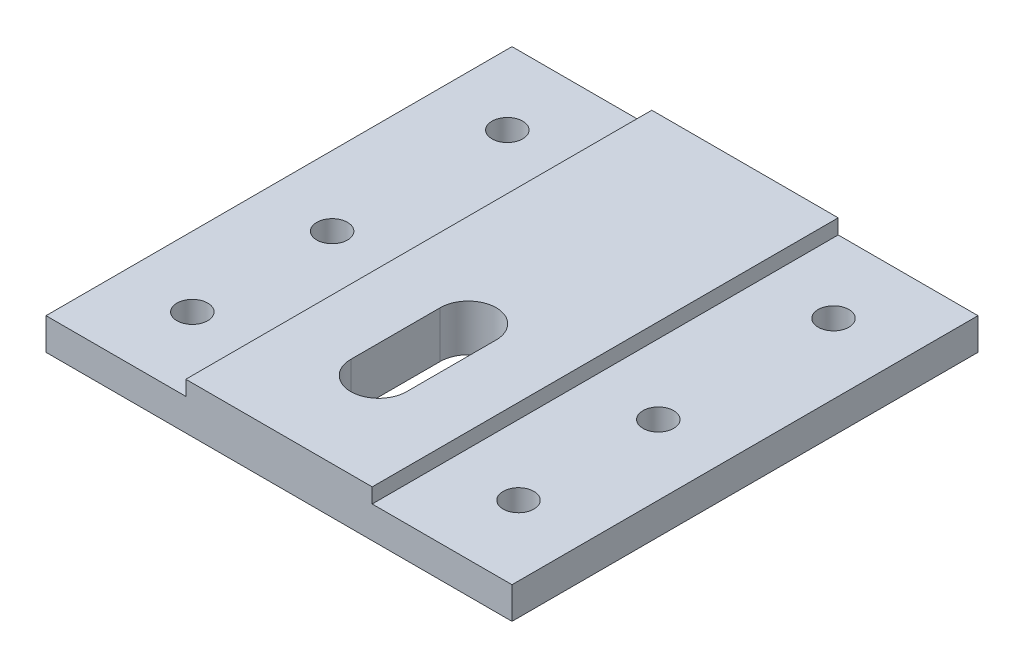
ISO-10303-21;
HEADER;
FILE_DESCRIPTION(('STEP AP214'),'2;1');
FILE_NAME('part.step','',(''),(''),'','','');
FILE_SCHEMA(('AUTOMOTIVE_DESIGN { 1 0 10303 214 1 1 1 1 }'));
ENDSEC;
DATA;
#1=APPLICATION_CONTEXT('core data for automotive mechanical design processes');
#2=APPLICATION_PROTOCOL_DEFINITION('international standard','automotive_design',2000,#1);
#3=PRODUCT_CONTEXT('',#1,'mechanical');
#4=PRODUCT('Part','Part','',(#3));
#5=PRODUCT_RELATED_PRODUCT_CATEGORY('part','',(#4));
#6=PRODUCT_DEFINITION_FORMATION('','',#4);
#7=PRODUCT_DEFINITION_CONTEXT('part definition',#1,'design');
#8=PRODUCT_DEFINITION('design','',#6,#7);
#9=PRODUCT_DEFINITION_SHAPE('','',#8);
#10=(LENGTH_UNIT() NAMED_UNIT(*) SI_UNIT(.MILLI.,.METRE.));
#11=(NAMED_UNIT(*) PLANE_ANGLE_UNIT() SI_UNIT($,.RADIAN.));
#12=(NAMED_UNIT(*) SI_UNIT($,.STERADIAN.) SOLID_ANGLE_UNIT());
#13=UNCERTAINTY_MEASURE_WITH_UNIT(LENGTH_MEASURE(1.E-05),#10,'distance_accuracy_value','');
#14=(GEOMETRIC_REPRESENTATION_CONTEXT(3) GLOBAL_UNCERTAINTY_ASSIGNED_CONTEXT((#13)) GLOBAL_UNIT_ASSIGNED_CONTEXT((#10,
#11,#12)) REPRESENTATION_CONTEXT('',''));
#15=CARTESIAN_POINT('',(0.,0.,0.));
#16=DIRECTION('',(0.,0.,1.));
#17=DIRECTION('',(1.,0.,0.));
#18=AXIS2_PLACEMENT_3D('',#15,#16,#17);
#19=CARTESIAN_POINT('',(-63.5,12.7,63.5));
#20=DIRECTION('',(1.,0.,0.));
#21=DIRECTION('',(0.,0.,-1.));
#22=AXIS2_PLACEMENT_3D('',#19,#20,#21);
#23=PLANE('',#22);
#24=DIRECTION('',(0.,-1.,0.));
#25=VECTOR('',#24,1.);
#26=CARTESIAN_POINT('',(-63.5,12.7,63.5));
#27=LINE('',#26,#25);
#28=CARTESIAN_POINT('',(-63.5,8.65841998049085,63.5));
#29=VERTEX_POINT('',#28);
#30=CARTESIAN_POINT('',(-63.5,0.,63.5));
#31=VERTEX_POINT('',#30);
#32=EDGE_CURVE('E11',#29,#31,#27,.T.);
#33=ORIENTED_EDGE('',*,*,#32,.F.);
#34=DIRECTION('',(0.,0.,1.));
#35=VECTOR('',#34,1.);
#36=CARTESIAN_POINT('',(-63.5,8.65841998049085,-63.5));
#37=LINE('',#36,#35);
#38=CARTESIAN_POINT('',(-63.5,8.65841998049085,-63.5));
#39=VERTEX_POINT('',#38);
#40=EDGE_CURVE('E230',#39,#29,#37,.T.);
#41=ORIENTED_EDGE('',*,*,#40,.F.);
#42=DIRECTION('',(0.,-1.,0.));
#43=VECTOR('',#42,1.);
#44=CARTESIAN_POINT('',(-63.5,12.7,-63.5));
#45=LINE('',#44,#43);
#46=CARTESIAN_POINT('',(-63.5,0.,-63.5));
#47=VERTEX_POINT('',#46);
#48=EDGE_CURVE('E280',#39,#47,#45,.T.);
#49=ORIENTED_EDGE('',*,*,#48,.T.);
#50=DIRECTION('',(0.,0.,1.));
#51=VECTOR('',#50,1.);
#52=CARTESIAN_POINT('',(-63.5,0.,63.5));
#53=LINE('',#52,#51);
#54=EDGE_CURVE('E242',#47,#31,#53,.T.);
#55=ORIENTED_EDGE('',*,*,#54,.T.);
#56=EDGE_LOOP('',(#33,#41,#49,#55));
#57=FACE_BOUND('',#56,.T.);
#58=ADVANCED_FACE('F39',(#57),#23,.F.);
#59=CARTESIAN_POINT('',(63.5,12.7,63.5));
#60=DIRECTION('',(0.,0.,-1.));
#61=DIRECTION('',(-1.,0.,0.));
#62=AXIS2_PLACEMENT_3D('',#59,#60,#61);
#63=PLANE('',#62);
#64=DIRECTION('',(1.,0.,0.));
#65=VECTOR('',#64,1.);
#66=CARTESIAN_POINT('',(63.5,12.7,63.5));
#67=LINE('',#66,#65);
#68=CARTESIAN_POINT('',(-25.4,12.7,63.5));
#69=VERTEX_POINT('',#68);
#70=CARTESIAN_POINT('',(25.4,12.7,63.5));
#71=VERTEX_POINT('',#70);
#72=EDGE_CURVE('E271',#69,#71,#67,.T.);
#73=ORIENTED_EDGE('',*,*,#72,.F.);
#74=DIRECTION('',(0.,1.,0.));
#75=VECTOR('',#74,1.);
#76=CARTESIAN_POINT('',(-25.4,12.7,63.5));
#77=LINE('',#76,#75);
#78=CARTESIAN_POINT('',(-25.4,8.65841998049085,63.5));
#79=VERTEX_POINT('',#78);
#80=EDGE_CURVE('E226',#79,#69,#77,.T.);
#81=ORIENTED_EDGE('',*,*,#80,.F.);
#82=DIRECTION('',(1.,0.,0.));
#83=VECTOR('',#82,1.);
#84=CARTESIAN_POINT('',(-63.5,8.65841998049085,63.5));
#85=LINE('',#84,#83);
#86=EDGE_CURVE('E231',#29,#79,#85,.T.);
#87=ORIENTED_EDGE('',*,*,#86,.F.);
#88=ORIENTED_EDGE('',*,*,#32,.T.);
#89=DIRECTION('',(1.,0.,0.));
#90=VECTOR('',#89,1.);
#91=CARTESIAN_POINT('',(63.5,0.,63.5));
#92=LINE('',#91,#90);
#93=CARTESIAN_POINT('',(63.5,0.,63.5));
#94=VERTEX_POINT('',#93);
#95=EDGE_CURVE('E284',#31,#94,#92,.T.);
#96=ORIENTED_EDGE('',*,*,#95,.T.);
#97=DIRECTION('',(0.,-1.,0.));
#98=VECTOR('',#97,1.);
#99=CARTESIAN_POINT('',(63.5,12.7,63.5));
#100=LINE('',#99,#98);
#101=CARTESIAN_POINT('',(63.5,8.65841998049085,63.5));
#102=VERTEX_POINT('',#101);
#103=EDGE_CURVE('E48',#102,#94,#100,.T.);
#104=ORIENTED_EDGE('',*,*,#103,.F.);
#105=DIRECTION('',(1.,0.,0.));
#106=VECTOR('',#105,1.);
#107=CARTESIAN_POINT('',(63.5,8.65841998049085,63.5));
#108=LINE('',#107,#106);
#109=CARTESIAN_POINT('',(25.4,8.65841998049085,63.5));
#110=VERTEX_POINT('',#109);
#111=EDGE_CURVE('E253',#110,#102,#108,.T.);
#112=ORIENTED_EDGE('',*,*,#111,.F.);
#113=DIRECTION('',(0.,-1.,0.));
#114=VECTOR('',#113,1.);
#115=CARTESIAN_POINT('',(25.4,12.7,63.5));
#116=LINE('',#115,#114);
#117=EDGE_CURVE('E220',#71,#110,#116,.T.);
#118=ORIENTED_EDGE('',*,*,#117,.F.);
#119=EDGE_LOOP('',(#73,#81,#87,#88,#96,#104,#112,#118));
#120=FACE_BOUND('',#119,.T.);
#121=ADVANCED_FACE('F311',(#120),#63,.F.);
#122=CARTESIAN_POINT('',(63.5,12.7,63.5));
#123=DIRECTION('',(-1.,0.,0.));
#124=DIRECTION('',(0.,0.,1.));
#125=AXIS2_PLACEMENT_3D('',#122,#123,#124);
#126=PLANE('',#125);
#127=DIRECTION('',(0.,-1.,0.));
#128=VECTOR('',#127,1.);
#129=CARTESIAN_POINT('',(63.5,12.7,-63.5));
#130=LINE('',#129,#128);
#131=CARTESIAN_POINT('',(63.5,8.65841998049085,-63.5));
#132=VERTEX_POINT('',#131);
#133=CARTESIAN_POINT('',(63.5,0.,-63.5));
#134=VERTEX_POINT('',#133);
#135=EDGE_CURVE('E297',#132,#134,#130,.T.);
#136=ORIENTED_EDGE('',*,*,#135,.F.);
#137=DIRECTION('',(0.,0.,1.));
#138=VECTOR('',#137,1.);
#139=CARTESIAN_POINT('',(63.5,8.65841998049085,-63.5));
#140=LINE('',#139,#138);
#141=EDGE_CURVE('E235',#132,#102,#140,.T.);
#142=ORIENTED_EDGE('',*,*,#141,.T.);
#143=ORIENTED_EDGE('',*,*,#103,.T.);
#144=DIRECTION('',(0.,0.,-1.));
#145=VECTOR('',#144,1.);
#146=CARTESIAN_POINT('',(63.5,0.,63.5));
#147=LINE('',#146,#145);
#148=EDGE_CURVE('E288',#94,#134,#147,.T.);
#149=ORIENTED_EDGE('',*,*,#148,.T.);
#150=EDGE_LOOP('',(#136,#142,#143,#149));
#151=FACE_BOUND('',#150,.T.);
#152=ADVANCED_FACE('F304',(#151),#126,.F.);
#153=CARTESIAN_POINT('',(63.5,12.7,-63.5));
#154=DIRECTION('',(0.,0.,1.));
#155=DIRECTION('',(1.,0.,0.));
#156=AXIS2_PLACEMENT_3D('',#153,#154,#155);
#157=PLANE('',#156);
#158=DIRECTION('',(1.,0.,0.));
#159=VECTOR('',#158,1.);
#160=CARTESIAN_POINT('',(-63.5,8.65841998049085,-63.5));
#161=LINE('',#160,#159);
#162=CARTESIAN_POINT('',(-25.4,8.65841998049085,-63.5));
#163=VERTEX_POINT('',#162);
#164=EDGE_CURVE('E221',#39,#163,#161,.T.);
#165=ORIENTED_EDGE('',*,*,#164,.T.);
#166=DIRECTION('',(0.,1.,0.));
#167=VECTOR('',#166,1.);
#168=CARTESIAN_POINT('',(-25.4,12.7,-63.5));
#169=LINE('',#168,#167);
#170=CARTESIAN_POINT('',(-25.4,12.7,-63.5));
#171=VERTEX_POINT('',#170);
#172=EDGE_CURVE('E225',#163,#171,#169,.T.);
#173=ORIENTED_EDGE('',*,*,#172,.T.);
#174=DIRECTION('',(-1.,0.,0.));
#175=VECTOR('',#174,1.);
#176=CARTESIAN_POINT('',(63.5,12.7,-63.5));
#177=LINE('',#176,#175);
#178=CARTESIAN_POINT('',(25.4,12.7,-63.5));
#179=VERTEX_POINT('',#178);
#180=EDGE_CURVE('E275',#179,#171,#177,.T.);
#181=ORIENTED_EDGE('',*,*,#180,.F.);
#182=DIRECTION('',(0.,-1.,0.));
#183=VECTOR('',#182,1.);
#184=CARTESIAN_POINT('',(25.4,12.7,-63.5));
#185=LINE('',#184,#183);
#186=CARTESIAN_POINT('',(25.4,8.65841998049085,-63.5));
#187=VERTEX_POINT('',#186);
#188=EDGE_CURVE('E248',#179,#187,#185,.T.);
#189=ORIENTED_EDGE('',*,*,#188,.T.);
#190=DIRECTION('',(1.,0.,0.));
#191=VECTOR('',#190,1.);
#192=CARTESIAN_POINT('',(63.5,8.65841998049085,-63.5));
#193=LINE('',#192,#191);
#194=EDGE_CURVE('E252',#187,#132,#193,.T.);
#195=ORIENTED_EDGE('',*,*,#194,.T.);
#196=ORIENTED_EDGE('',*,*,#135,.T.);
#197=DIRECTION('',(-1.,0.,0.));
#198=VECTOR('',#197,1.);
#199=CARTESIAN_POINT('',(63.5,0.,-63.5));
#200=LINE('',#199,#198);
#201=EDGE_CURVE('E276',#134,#47,#200,.T.);
#202=ORIENTED_EDGE('',*,*,#201,.T.);
#203=ORIENTED_EDGE('',*,*,#48,.F.);
#204=EDGE_LOOP('',(#165,#173,#181,#189,#195,#196,#202,#203));
#205=FACE_BOUND('',#204,.T.);
#206=ADVANCED_FACE('F319',(#205),#157,.F.);
#207=CARTESIAN_POINT('',(0.,12.7,0.));
#208=DIRECTION('',(0.,1.,0.));
#209=DIRECTION('',(0.,0.,1.));
#210=AXIS2_PLACEMENT_3D('',#207,#208,#209);
#211=PLANE('',#210);
#212=CARTESIAN_POINT('',(0.,12.7,11.938));
#213=DIRECTION('',(0.,-1.,0.));
#214=DIRECTION('',(0.,0.,-1.));
#215=AXIS2_PLACEMENT_3D('',#212,#213,#214);
#216=CIRCLE('',#215,7.62);
#217=CARTESIAN_POINT('',(-7.62,12.7,11.938));
#218=VERTEX_POINT('',#217);
#219=CARTESIAN_POINT('',(7.62,12.7,11.938));
#220=VERTEX_POINT('',#219);
#221=EDGE_CURVE('E131',#218,#220,#216,.T.);
#222=ORIENTED_EDGE('',*,*,#221,.T.);
#223=DIRECTION('',(0.,0.,1.));
#224=VECTOR('',#223,1.);
#225=CARTESIAN_POINT('',(7.62,12.7,11.938));
#226=LINE('',#225,#224);
#227=CARTESIAN_POINT('',(7.62000000000001,12.7,36.322));
#228=VERTEX_POINT('',#227);
#229=EDGE_CURVE('E141',#220,#228,#226,.T.);
#230=ORIENTED_EDGE('',*,*,#229,.T.);
#231=CARTESIAN_POINT('',(0.,12.7,36.322));
#232=DIRECTION('',(0.,-1.,0.));
#233=DIRECTION('',(0.,0.,-1.));
#234=AXIS2_PLACEMENT_3D('',#231,#232,#233);
#235=CIRCLE('',#234,7.62);
#236=CARTESIAN_POINT('',(-7.62000000000001,12.7,36.322));
#237=VERTEX_POINT('',#236);
#238=EDGE_CURVE('E55',#228,#237,#235,.T.);
#239=ORIENTED_EDGE('',*,*,#238,.T.);
#240=DIRECTION('',(0.,0.,1.));
#241=VECTOR('',#240,1.);
#242=CARTESIAN_POINT('',(-7.62,12.7,11.938));
#243=LINE('',#242,#241);
#244=EDGE_CURVE('E138',#218,#237,#243,.T.);
#245=ORIENTED_EDGE('',*,*,#244,.F.);
#246=EDGE_LOOP('',(#222,#230,#239,#245));
#247=FACE_BOUND('',#246,.T.);
#248=DIRECTION('',(0.,0.,1.));
#249=VECTOR('',#248,1.);
#250=CARTESIAN_POINT('',(-25.4,12.7,-63.5));
#251=LINE('',#250,#249);
#252=EDGE_CURVE('E238',#171,#69,#251,.T.);
#253=ORIENTED_EDGE('',*,*,#252,.T.);
#254=ORIENTED_EDGE('',*,*,#72,.T.);
#255=DIRECTION('',(0.,0.,1.));
#256=VECTOR('',#255,1.);
#257=CARTESIAN_POINT('',(25.4,12.7,-63.5));
#258=LINE('',#257,#256);
#259=EDGE_CURVE('E257',#179,#71,#258,.T.);
#260=ORIENTED_EDGE('',*,*,#259,.F.);
#261=ORIENTED_EDGE('',*,*,#180,.T.);
#262=EDGE_LOOP('',(#253,#254,#260,#261));
#263=FACE_BOUND('',#262,.T.);
#264=ADVANCED_FACE('F146',(#247,#263),#211,.T.);
#265=CARTESIAN_POINT('',(0.,0.,0.));
#266=DIRECTION('',(0.,1.,0.));
#267=DIRECTION('',(0.,0.,1.));
#268=AXIS2_PLACEMENT_3D('',#265,#266,#267);
#269=PLANE('',#268);
#270=DIRECTION('',(0.,0.,1.));
#271=VECTOR('',#270,1.);
#272=CARTESIAN_POINT('',(7.62,0.,11.938));
#273=LINE('',#272,#271);
#274=CARTESIAN_POINT('',(7.62,0.,11.938));
#275=VERTEX_POINT('',#274);
#276=CARTESIAN_POINT('',(7.62000000000001,0.,36.322));
#277=VERTEX_POINT('',#276);
#278=EDGE_CURVE('E162',#275,#277,#273,.T.);
#279=ORIENTED_EDGE('',*,*,#278,.F.);
#280=CARTESIAN_POINT('',(0.,0.,11.938));
#281=DIRECTION('',(0.,-1.,0.));
#282=DIRECTION('',(0.,0.,-1.));
#283=AXIS2_PLACEMENT_3D('',#280,#281,#282);
#284=CIRCLE('',#283,7.62);
#285=CARTESIAN_POINT('',(-7.62,0.,11.938));
#286=VERTEX_POINT('',#285);
#287=EDGE_CURVE('E63',#286,#275,#284,.T.);
#288=ORIENTED_EDGE('',*,*,#287,.F.);
#289=DIRECTION('',(0.,0.,1.));
#290=VECTOR('',#289,1.);
#291=CARTESIAN_POINT('',(-7.62,0.,11.938));
#292=LINE('',#291,#290);
#293=CARTESIAN_POINT('',(-7.62000000000001,0.,36.322));
#294=VERTEX_POINT('',#293);
#295=EDGE_CURVE('E149',#286,#294,#292,.T.);
#296=ORIENTED_EDGE('',*,*,#295,.T.);
#297=CARTESIAN_POINT('',(0.,0.,36.322));
#298=DIRECTION('',(0.,-1.,0.));
#299=DIRECTION('',(0.,0.,-1.));
#300=AXIS2_PLACEMENT_3D('',#297,#298,#299);
#301=CIRCLE('',#300,7.62);
#302=EDGE_CURVE('E153',#277,#294,#301,.T.);
#303=ORIENTED_EDGE('',*,*,#302,.F.);
#304=EDGE_LOOP('',(#279,#288,#296,#303));
#305=FACE_BOUND('',#304,.T.);
#306=CARTESIAN_POINT('',(44.45,0.,-43.18));
#307=DIRECTION('',(0.,-1.,0.));
#308=DIRECTION('',(0.,0.,-1.));
#309=AXIS2_PLACEMENT_3D('',#306,#307,#308);
#310=CIRCLE('',#309,4.191);
#311=CARTESIAN_POINT('',(44.45,0.,-47.371));
#312=VERTEX_POINT('',#311);
#313=EDGE_CURVE('E171',#312,#312,#310,.T.);
#314=ORIENTED_EDGE('',*,*,#313,.F.);
#315=EDGE_LOOP('',(#314));
#316=FACE_BOUND('',#315,.T.);
#317=CARTESIAN_POINT('',(44.45,0.,4.572));
#318=DIRECTION('',(0.,-1.,0.));
#319=DIRECTION('',(0.,0.,-1.));
#320=AXIS2_PLACEMENT_3D('',#317,#318,#319);
#321=CIRCLE('',#320,4.191);
#322=CARTESIAN_POINT('',(44.45,0.,0.381000000000003));
#323=VERTEX_POINT('',#322);
#324=EDGE_CURVE('E184',#323,#323,#321,.T.);
#325=ORIENTED_EDGE('',*,*,#324,.F.);
#326=EDGE_LOOP('',(#325));
#327=FACE_BOUND('',#326,.T.);
#328=CARTESIAN_POINT('',(44.45,0.,42.672));
#329=DIRECTION('',(0.,-1.,0.));
#330=DIRECTION('',(0.,0.,-1.));
#331=AXIS2_PLACEMENT_3D('',#328,#329,#330);
#332=CIRCLE('',#331,4.191);
#333=CARTESIAN_POINT('',(44.45,0.,38.481));
#334=VERTEX_POINT('',#333);
#335=EDGE_CURVE('E192',#334,#334,#332,.T.);
#336=ORIENTED_EDGE('',*,*,#335,.F.);
#337=EDGE_LOOP('',(#336));
#338=FACE_BOUND('',#337,.T.);
#339=CARTESIAN_POINT('',(-44.45,0.,-43.18));
#340=DIRECTION('',(0.,-1.,0.));
#341=DIRECTION('',(0.,0.,-1.));
#342=AXIS2_PLACEMENT_3D('',#339,#340,#341);
#343=CIRCLE('',#342,4.191);
#344=CARTESIAN_POINT('',(-44.45,0.,-47.371));
#345=VERTEX_POINT('',#344);
#346=EDGE_CURVE('E200',#345,#345,#343,.T.);
#347=ORIENTED_EDGE('',*,*,#346,.F.);
#348=EDGE_LOOP('',(#347));
#349=FACE_BOUND('',#348,.T.);
#350=CARTESIAN_POINT('',(-44.45,0.,4.572));
#351=DIRECTION('',(0.,-1.,0.));
#352=DIRECTION('',(0.,0.,-1.));
#353=AXIS2_PLACEMENT_3D('',#350,#351,#352);
#354=CIRCLE('',#353,4.191);
#355=CARTESIAN_POINT('',(-44.45,0.,0.380999999999999));
#356=VERTEX_POINT('',#355);
#357=EDGE_CURVE('E204',#356,#356,#354,.T.);
#358=ORIENTED_EDGE('',*,*,#357,.F.);
#359=EDGE_LOOP('',(#358));
#360=FACE_BOUND('',#359,.T.);
#361=CARTESIAN_POINT('',(-44.45,0.,42.672));
#362=DIRECTION('',(0.,-1.,0.));
#363=DIRECTION('',(0.,0.,-1.));
#364=AXIS2_PLACEMENT_3D('',#361,#362,#363);
#365=CIRCLE('',#364,4.191);
#366=CARTESIAN_POINT('',(-44.45,0.,38.481));
#367=VERTEX_POINT('',#366);
#368=EDGE_CURVE('E212',#367,#367,#365,.T.);
#369=ORIENTED_EDGE('',*,*,#368,.F.);
#370=EDGE_LOOP('',(#369));
#371=FACE_BOUND('',#370,.T.);
#372=ORIENTED_EDGE('',*,*,#54,.F.);
#373=ORIENTED_EDGE('',*,*,#201,.F.);
#374=ORIENTED_EDGE('',*,*,#148,.F.);
#375=ORIENTED_EDGE('',*,*,#95,.F.);
#376=EDGE_LOOP('',(#372,#373,#374,#375));
#377=FACE_BOUND('',#376,.T.);
#378=ADVANCED_FACE('F316',(#305,#316,#327,#338,#349,#360,#371,#377),#269,.F.);
#379=CARTESIAN_POINT('',(63.5,8.65841998049085,-63.5));
#380=DIRECTION('',(0.,-1.,0.));
#381=DIRECTION('',(1.,0.,0.));
#382=AXIS2_PLACEMENT_3D('',#379,#380,#381);
#383=PLANE('',#382);
#384=CARTESIAN_POINT('',(44.45,8.65841998049085,-43.18));
#385=DIRECTION('',(0.,-1.,0.));
#386=DIRECTION('',(1.,0.,0.));
#387=AXIS2_PLACEMENT_3D('',#384,#385,#386);
#388=CIRCLE('',#387,4.191);
#389=CARTESIAN_POINT('',(48.641,8.65841998049085,-43.18));
#390=VERTEX_POINT('',#389);
#391=EDGE_CURVE('E180',#390,#390,#388,.T.);
#392=ORIENTED_EDGE('',*,*,#391,.T.);
#393=EDGE_LOOP('',(#392));
#394=FACE_BOUND('',#393,.T.);
#395=CARTESIAN_POINT('',(44.45,8.65841998049085,4.572));
#396=DIRECTION('',(0.,-1.,0.));
#397=DIRECTION('',(1.,0.,0.));
#398=AXIS2_PLACEMENT_3D('',#395,#396,#397);
#399=CIRCLE('',#398,4.191);
#400=CARTESIAN_POINT('',(48.641,8.65841998049085,4.572));
#401=VERTEX_POINT('',#400);
#402=EDGE_CURVE('E188',#401,#401,#399,.T.);
#403=ORIENTED_EDGE('',*,*,#402,.T.);
#404=EDGE_LOOP('',(#403));
#405=FACE_BOUND('',#404,.T.);
#406=CARTESIAN_POINT('',(44.45,8.65841998049085,42.672));
#407=DIRECTION('',(0.,-1.,0.));
#408=DIRECTION('',(1.,0.,0.));
#409=AXIS2_PLACEMENT_3D('',#406,#407,#408);
#410=CIRCLE('',#409,4.191);
#411=CARTESIAN_POINT('',(48.641,8.65841998049085,42.672));
#412=VERTEX_POINT('',#411);
#413=EDGE_CURVE('E196',#412,#412,#410,.T.);
#414=ORIENTED_EDGE('',*,*,#413,.T.);
#415=EDGE_LOOP('',(#414));
#416=FACE_BOUND('',#415,.T.);
#417=ORIENTED_EDGE('',*,*,#111,.T.);
#418=ORIENTED_EDGE('',*,*,#141,.F.);
#419=ORIENTED_EDGE('',*,*,#194,.F.);
#420=DIRECTION('',(0.,0.,1.));
#421=VECTOR('',#420,1.);
#422=CARTESIAN_POINT('',(25.4,8.65841998049085,-63.5));
#423=LINE('',#422,#421);
#424=EDGE_CURVE('E266',#187,#110,#423,.T.);
#425=ORIENTED_EDGE('',*,*,#424,.T.);
#426=EDGE_LOOP('',(#417,#418,#419,#425));
#427=FACE_BOUND('',#426,.T.);
#428=ADVANCED_FACE('F323',(#394,#405,#416,#427),#383,.F.);
#429=CARTESIAN_POINT('',(25.4,12.7,-63.5));
#430=DIRECTION('',(-1.,0.,0.));
#431=DIRECTION('',(0.,0.,1.));
#432=AXIS2_PLACEMENT_3D('',#429,#430,#431);
#433=PLANE('',#432);
#434=ORIENTED_EDGE('',*,*,#117,.T.);
#435=ORIENTED_EDGE('',*,*,#424,.F.);
#436=ORIENTED_EDGE('',*,*,#188,.F.);
#437=ORIENTED_EDGE('',*,*,#259,.T.);
#438=EDGE_LOOP('',(#434,#435,#436,#437));
#439=FACE_BOUND('',#438,.T.);
#440=ADVANCED_FACE('F351',(#439),#433,.F.);
#441=CARTESIAN_POINT('',(-25.4,12.7,-63.5));
#442=DIRECTION('',(1.,0.,0.));
#443=DIRECTION('',(0.,0.,-1.));
#444=AXIS2_PLACEMENT_3D('',#441,#442,#443);
#445=PLANE('',#444);
#446=ORIENTED_EDGE('',*,*,#80,.T.);
#447=ORIENTED_EDGE('',*,*,#252,.F.);
#448=ORIENTED_EDGE('',*,*,#172,.F.);
#449=DIRECTION('',(0.,0.,1.));
#450=VECTOR('',#449,1.);
#451=CARTESIAN_POINT('',(-25.4,8.65841998049085,-63.5));
#452=LINE('',#451,#450);
#453=EDGE_CURVE('E243',#163,#79,#452,.T.);
#454=ORIENTED_EDGE('',*,*,#453,.T.);
#455=EDGE_LOOP('',(#446,#447,#448,#454));
#456=FACE_BOUND('',#455,.T.);
#457=ADVANCED_FACE('F330',(#456),#445,.F.);
#458=CARTESIAN_POINT('',(-63.5,8.65841998049085,-63.5));
#459=DIRECTION('',(0.,-1.,0.));
#460=DIRECTION('',(0.,0.,-1.));
#461=AXIS2_PLACEMENT_3D('',#458,#459,#460);
#462=PLANE('',#461);
#463=CARTESIAN_POINT('',(-44.45,8.65841998049085,-43.18));
#464=DIRECTION('',(0.,-1.,0.));
#465=DIRECTION('',(0.,0.,-1.));
#466=AXIS2_PLACEMENT_3D('',#463,#464,#465);
#467=CIRCLE('',#466,4.191);
#468=CARTESIAN_POINT('',(-44.45,8.65841998049085,-47.371));
#469=VERTEX_POINT('',#468);
#470=EDGE_CURVE('E42',#469,#469,#467,.T.);
#471=ORIENTED_EDGE('',*,*,#470,.T.);
#472=EDGE_LOOP('',(#471));
#473=FACE_BOUND('',#472,.T.);
#474=CARTESIAN_POINT('',(-44.45,8.65841998049085,4.572));
#475=DIRECTION('',(0.,-1.,0.));
#476=DIRECTION('',(0.,0.,-1.));
#477=AXIS2_PLACEMENT_3D('',#474,#475,#476);
#478=CIRCLE('',#477,4.191);
#479=CARTESIAN_POINT('',(-44.45,8.65841998049085,0.381000000000003));
#480=VERTEX_POINT('',#479);
#481=EDGE_CURVE('E208',#480,#480,#478,.T.);
#482=ORIENTED_EDGE('',*,*,#481,.T.);
#483=EDGE_LOOP('',(#482));
#484=FACE_BOUND('',#483,.T.);
#485=CARTESIAN_POINT('',(-44.45,8.65841998049085,42.672));
#486=DIRECTION('',(0.,-1.,0.));
#487=DIRECTION('',(0.,0.,-1.));
#488=AXIS2_PLACEMENT_3D('',#485,#486,#487);
#489=CIRCLE('',#488,4.191);
#490=CARTESIAN_POINT('',(-44.45,8.65841998049085,38.481));
#491=VERTEX_POINT('',#490);
#492=EDGE_CURVE('E216',#491,#491,#489,.T.);
#493=ORIENTED_EDGE('',*,*,#492,.T.);
#494=EDGE_LOOP('',(#493));
#495=FACE_BOUND('',#494,.T.);
#496=ORIENTED_EDGE('',*,*,#86,.T.);
#497=ORIENTED_EDGE('',*,*,#453,.F.);
#498=ORIENTED_EDGE('',*,*,#164,.F.);
#499=ORIENTED_EDGE('',*,*,#40,.T.);
#500=EDGE_LOOP('',(#496,#497,#498,#499));
#501=FACE_BOUND('',#500,.T.);
#502=ADVANCED_FACE('F333',(#473,#484,#495,#501),#462,.F.);
#503=CARTESIAN_POINT('',(-44.45,0.,42.672));
#504=DIRECTION('',(0.,-1.,0.));
#505=DIRECTION('',(0.,0.,-1.));
#506=AXIS2_PLACEMENT_3D('',#503,#504,#505);
#507=CYLINDRICAL_SURFACE('',#506,4.191);
#508=ORIENTED_EDGE('',*,*,#368,.T.);
#509=EDGE_LOOP('',(#508));
#510=FACE_BOUND('',#509,.T.);
#511=ORIENTED_EDGE('',*,*,#492,.F.);
#512=EDGE_LOOP('',(#511));
#513=FACE_BOUND('',#512,.T.);
#514=ADVANCED_FACE('F359',(#510,#513),#507,.F.);
#515=CARTESIAN_POINT('',(-44.45,0.,4.572));
#516=DIRECTION('',(0.,-1.,0.));
#517=DIRECTION('',(0.,0.,-1.));
#518=AXIS2_PLACEMENT_3D('',#515,#516,#517);
#519=CYLINDRICAL_SURFACE('',#518,4.191);
#520=ORIENTED_EDGE('',*,*,#357,.T.);
#521=EDGE_LOOP('',(#520));
#522=FACE_BOUND('',#521,.T.);
#523=ORIENTED_EDGE('',*,*,#481,.F.);
#524=EDGE_LOOP('',(#523));
#525=FACE_BOUND('',#524,.T.);
#526=ADVANCED_FACE('F365',(#522,#525),#519,.F.);
#527=CARTESIAN_POINT('',(-44.45,0.,-43.18));
#528=DIRECTION('',(0.,-1.,0.));
#529=DIRECTION('',(0.,0.,-1.));
#530=AXIS2_PLACEMENT_3D('',#527,#528,#529);
#531=CYLINDRICAL_SURFACE('',#530,4.191);
#532=ORIENTED_EDGE('',*,*,#346,.T.);
#533=EDGE_LOOP('',(#532));
#534=FACE_BOUND('',#533,.T.);
#535=ORIENTED_EDGE('',*,*,#470,.F.);
#536=EDGE_LOOP('',(#535));
#537=FACE_BOUND('',#536,.T.);
#538=ADVANCED_FACE('F369',(#534,#537),#531,.F.);
#539=CARTESIAN_POINT('',(44.45,0.,42.672));
#540=DIRECTION('',(0.,-1.,0.));
#541=DIRECTION('',(0.,0.,-1.));
#542=AXIS2_PLACEMENT_3D('',#539,#540,#541);
#543=CYLINDRICAL_SURFACE('',#542,4.191);
#544=ORIENTED_EDGE('',*,*,#335,.T.);
#545=EDGE_LOOP('',(#544));
#546=FACE_BOUND('',#545,.T.);
#547=ORIENTED_EDGE('',*,*,#413,.F.);
#548=EDGE_LOOP('',(#547));
#549=FACE_BOUND('',#548,.T.);
#550=ADVANCED_FACE('F373',(#546,#549),#543,.F.);
#551=CARTESIAN_POINT('',(44.45,0.,4.572));
#552=DIRECTION('',(0.,-1.,0.));
#553=DIRECTION('',(0.,0.,-1.));
#554=AXIS2_PLACEMENT_3D('',#551,#552,#553);
#555=CYLINDRICAL_SURFACE('',#554,4.191);
#556=ORIENTED_EDGE('',*,*,#324,.T.);
#557=EDGE_LOOP('',(#556));
#558=FACE_BOUND('',#557,.T.);
#559=ORIENTED_EDGE('',*,*,#402,.F.);
#560=EDGE_LOOP('',(#559));
#561=FACE_BOUND('',#560,.T.);
#562=ADVANCED_FACE('F377',(#558,#561),#555,.F.);
#563=CARTESIAN_POINT('',(44.45,0.,-43.18));
#564=DIRECTION('',(0.,-1.,0.));
#565=DIRECTION('',(0.,0.,-1.));
#566=AXIS2_PLACEMENT_3D('',#563,#564,#565);
#567=CYLINDRICAL_SURFACE('',#566,4.191);
#568=ORIENTED_EDGE('',*,*,#313,.T.);
#569=EDGE_LOOP('',(#568));
#570=FACE_BOUND('',#569,.T.);
#571=ORIENTED_EDGE('',*,*,#391,.F.);
#572=EDGE_LOOP('',(#571));
#573=FACE_BOUND('',#572,.T.);
#574=ADVANCED_FACE('F381',(#570,#573),#567,.F.);
#575=CARTESIAN_POINT('',(0.,12.7,11.938));
#576=DIRECTION('',(0.,-1.,0.));
#577=DIRECTION('',(0.,0.,-1.));
#578=AXIS2_PLACEMENT_3D('',#575,#576,#577);
#579=CYLINDRICAL_SURFACE('',#578,7.62);
#580=ORIENTED_EDGE('',*,*,#287,.T.);
#581=DIRECTION('',(0.,-1.,0.));
#582=VECTOR('',#581,1.);
#583=CARTESIAN_POINT('',(7.62,12.7,11.938));
#584=LINE('',#583,#582);
#585=EDGE_CURVE('E127',#220,#275,#584,.T.);
#586=ORIENTED_EDGE('',*,*,#585,.F.);
#587=ORIENTED_EDGE('',*,*,#221,.F.);
#588=DIRECTION('',(0.,-1.,0.));
#589=VECTOR('',#588,1.);
#590=CARTESIAN_POINT('',(-7.62,12.7,11.938));
#591=LINE('',#590,#589);
#592=EDGE_CURVE('E168',#218,#286,#591,.T.);
#593=ORIENTED_EDGE('',*,*,#592,.T.);
#594=EDGE_LOOP('',(#580,#586,#587,#593));
#595=FACE_BOUND('',#594,.T.);
#596=ADVANCED_FACE('F129',(#595),#579,.F.);
#597=CARTESIAN_POINT('',(-7.62,12.7,11.938));
#598=DIRECTION('',(1.,0.,0.));
#599=DIRECTION('',(0.,0.,-1.));
#600=AXIS2_PLACEMENT_3D('',#597,#598,#599);
#601=PLANE('',#600);
#602=ORIENTED_EDGE('',*,*,#295,.F.);
#603=ORIENTED_EDGE('',*,*,#592,.F.);
#604=ORIENTED_EDGE('',*,*,#244,.T.);
#605=DIRECTION('',(0.,-1.,0.));
#606=VECTOR('',#605,1.);
#607=CARTESIAN_POINT('',(-7.62000000000001,12.7,36.322));
#608=LINE('',#607,#606);
#609=EDGE_CURVE('E172',#237,#294,#608,.T.);
#610=ORIENTED_EDGE('',*,*,#609,.T.);
#611=EDGE_LOOP('',(#602,#603,#604,#610));
#612=FACE_BOUND('',#611,.T.);
#613=ADVANCED_FACE('F388',(#612),#601,.T.);
#614=CARTESIAN_POINT('',(0.,12.7,36.322));
#615=DIRECTION('',(0.,-1.,0.));
#616=DIRECTION('',(0.,0.,-1.));
#617=AXIS2_PLACEMENT_3D('',#614,#615,#616);
#618=CYLINDRICAL_SURFACE('',#617,7.62);
#619=ORIENTED_EDGE('',*,*,#302,.T.);
#620=ORIENTED_EDGE('',*,*,#609,.F.);
#621=ORIENTED_EDGE('',*,*,#238,.F.);
#622=DIRECTION('',(0.,-1.,0.));
#623=VECTOR('',#622,1.);
#624=CARTESIAN_POINT('',(7.62000000000001,12.7,36.322));
#625=LINE('',#624,#623);
#626=EDGE_CURVE('E137',#228,#277,#625,.T.);
#627=ORIENTED_EDGE('',*,*,#626,.T.);
#628=EDGE_LOOP('',(#619,#620,#621,#627));
#629=FACE_BOUND('',#628,.T.);
#630=ADVANCED_FACE('F391',(#629),#618,.F.);
#631=CARTESIAN_POINT('',(7.62,12.7,11.938));
#632=DIRECTION('',(1.,0.,0.));
#633=DIRECTION('',(0.,0.,-1.));
#634=AXIS2_PLACEMENT_3D('',#631,#632,#633);
#635=PLANE('',#634);
#636=ORIENTED_EDGE('',*,*,#278,.T.);
#637=ORIENTED_EDGE('',*,*,#626,.F.);
#638=ORIENTED_EDGE('',*,*,#229,.F.);
#639=ORIENTED_EDGE('',*,*,#585,.T.);
#640=EDGE_LOOP('',(#636,#637,#638,#639));
#641=FACE_BOUND('',#640,.T.);
#642=ADVANCED_FACE('F142',(#641),#635,.F.);
#643=CLOSED_SHELL('',(#58,#121,#152,#206,#264,#378,#428,#440,#457,#502,#514,#526,#538,#550,#562,
#574,#596,#613,#630,#642));
#644=MANIFOLD_SOLID_BREP('B2',#643);
#645=ADVANCED_BREP_SHAPE_REPRESENTATION('',(#18,#644),#14);
#646=SHAPE_DEFINITION_REPRESENTATION(#9,#645);
ENDSEC;
END-ISO-10303-21;
